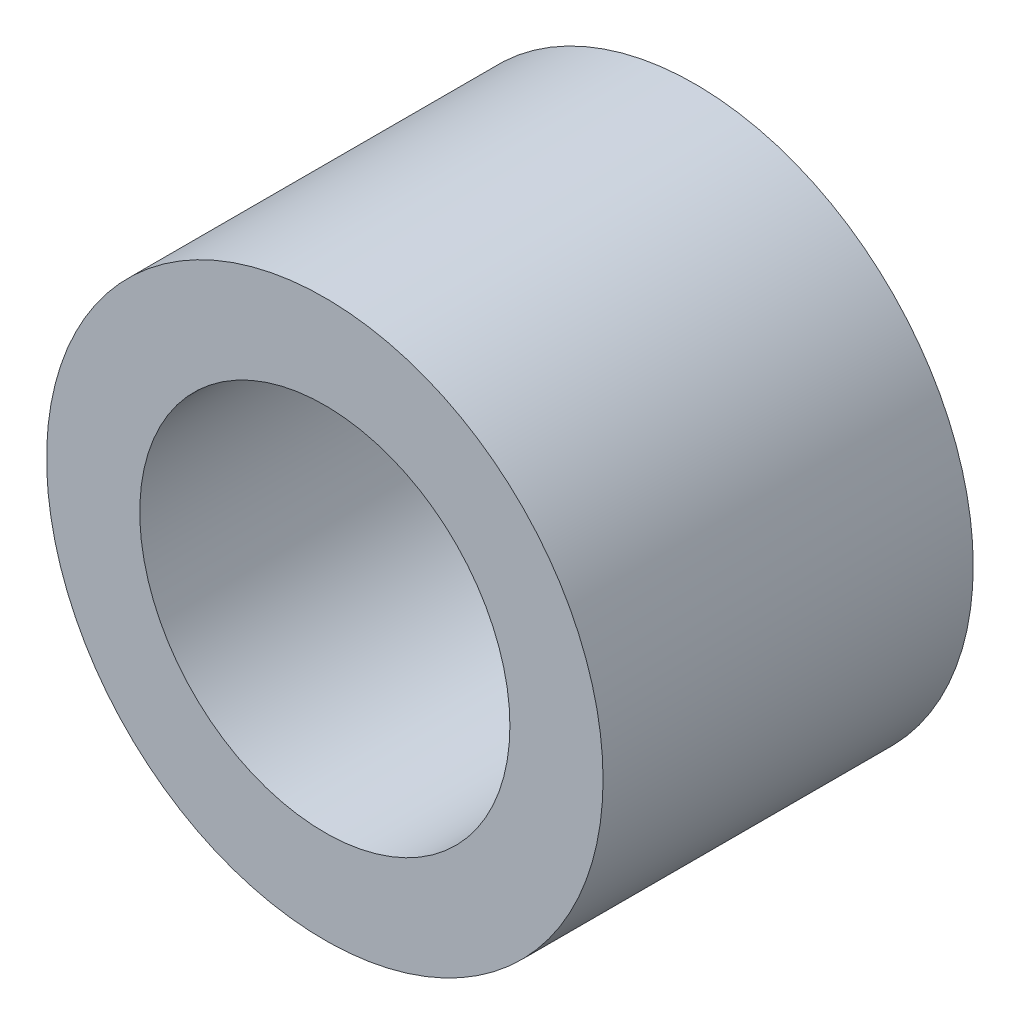
ISO-10303-21;
HEADER;
FILE_DESCRIPTION(('STEP AP214'),'2;1');
FILE_NAME('part.step','',(''),(''),'','','');
FILE_SCHEMA(('AUTOMOTIVE_DESIGN { 1 0 10303 214 1 1 1 1 }'));
ENDSEC;
DATA;
#1=APPLICATION_CONTEXT('core data for automotive mechanical design processes');
#2=APPLICATION_PROTOCOL_DEFINITION('international standard','automotive_design',2000,#1);
#3=PRODUCT_CONTEXT('',#1,'mechanical');
#4=PRODUCT('Part','Part','',(#3));
#5=PRODUCT_RELATED_PRODUCT_CATEGORY('part','',(#4));
#6=PRODUCT_DEFINITION_FORMATION('','',#4);
#7=PRODUCT_DEFINITION_CONTEXT('part definition',#1,'design');
#8=PRODUCT_DEFINITION('design','',#6,#7);
#9=PRODUCT_DEFINITION_SHAPE('','',#8);
#10=(LENGTH_UNIT() NAMED_UNIT(*) SI_UNIT(.MILLI.,.METRE.));
#11=(NAMED_UNIT(*) PLANE_ANGLE_UNIT() SI_UNIT($,.RADIAN.));
#12=(NAMED_UNIT(*) SI_UNIT($,.STERADIAN.) SOLID_ANGLE_UNIT());
#13=UNCERTAINTY_MEASURE_WITH_UNIT(LENGTH_MEASURE(1.E-05),#10,'distance_accuracy_value','');
#14=(GEOMETRIC_REPRESENTATION_CONTEXT(3) GLOBAL_UNCERTAINTY_ASSIGNED_CONTEXT((#13)) GLOBAL_UNIT_ASSIGNED_CONTEXT((#10,
#11,#12)) REPRESENTATION_CONTEXT('',''));
#15=CARTESIAN_POINT('',(0.,0.,0.));
#16=DIRECTION('',(0.,0.,1.));
#17=DIRECTION('',(1.,0.,0.));
#18=AXIS2_PLACEMENT_3D('',#15,#16,#17);
#19=CARTESIAN_POINT('',(0.,0.,3.));
#20=DIRECTION('',(0.,0.,1.));
#21=DIRECTION('',(1.,0.,0.));
#22=AXIS2_PLACEMENT_3D('',#19,#20,#21);
#23=PLANE('',#22);
#24=CARTESIAN_POINT('',(0.,0.,3.));
#25=DIRECTION('',(0.,0.,1.));
#26=DIRECTION('',(1.,0.,0.));
#27=AXIS2_PLACEMENT_3D('',#24,#25,#26);
#28=CIRCLE('',#27,4.51);
#29=CARTESIAN_POINT('',(4.51,0.,3.));
#30=VERTEX_POINT('',#29);
#31=EDGE_CURVE('E10',#30,#30,#28,.T.);
#32=ORIENTED_EDGE('',*,*,#31,.T.);
#33=EDGE_LOOP('',(#32));
#34=FACE_BOUND('',#33,.T.);
#35=CARTESIAN_POINT('',(0.,0.,3.));
#36=DIRECTION('',(0.,0.,1.));
#37=DIRECTION('',(1.,0.,0.));
#38=AXIS2_PLACEMENT_3D('',#35,#36,#37);
#39=CIRCLE('',#38,3.);
#40=CARTESIAN_POINT('',(3.,0.,3.));
#41=VERTEX_POINT('',#40);
#42=EDGE_CURVE('E43',#41,#41,#39,.T.);
#43=ORIENTED_EDGE('',*,*,#42,.F.);
#44=EDGE_LOOP('',(#43));
#45=FACE_BOUND('',#44,.T.);
#46=ADVANCED_FACE('F32',(#34,#45),#23,.T.);
#47=CARTESIAN_POINT('',(0.,0.,-3.));
#48=DIRECTION('',(0.,0.,1.));
#49=DIRECTION('',(1.,0.,0.));
#50=AXIS2_PLACEMENT_3D('',#47,#48,#49);
#51=PLANE('',#50);
#52=CARTESIAN_POINT('',(0.,0.,-3.));
#53=DIRECTION('',(0.,0.,1.));
#54=DIRECTION('',(1.,0.,0.));
#55=AXIS2_PLACEMENT_3D('',#52,#53,#54);
#56=CIRCLE('',#55,4.51);
#57=CARTESIAN_POINT('',(4.51,0.,-3.));
#58=VERTEX_POINT('',#57);
#59=EDGE_CURVE('E36',#58,#58,#56,.T.);
#60=ORIENTED_EDGE('',*,*,#59,.F.);
#61=EDGE_LOOP('',(#60));
#62=FACE_BOUND('',#61,.T.);
#63=CARTESIAN_POINT('',(0.,0.,-3.));
#64=DIRECTION('',(0.,0.,1.));
#65=DIRECTION('',(1.,0.,0.));
#66=AXIS2_PLACEMENT_3D('',#63,#64,#65);
#67=CIRCLE('',#66,3.);
#68=CARTESIAN_POINT('',(3.,0.,-3.));
#69=VERTEX_POINT('',#68);
#70=EDGE_CURVE('E45',#69,#69,#67,.T.);
#71=ORIENTED_EDGE('',*,*,#70,.T.);
#72=EDGE_LOOP('',(#71));
#73=FACE_BOUND('',#72,.T.);
#74=ADVANCED_FACE('F55',(#62,#73),#51,.F.);
#75=CARTESIAN_POINT('',(0.,0.,3.));
#76=DIRECTION('',(0.,0.,-1.));
#77=DIRECTION('',(-1.,0.,0.));
#78=AXIS2_PLACEMENT_3D('',#75,#76,#77);
#79=CYLINDRICAL_SURFACE('',#78,4.51);
#80=ORIENTED_EDGE('',*,*,#31,.F.);
#81=EDGE_LOOP('',(#80));
#82=FACE_BOUND('',#81,.T.);
#83=ORIENTED_EDGE('',*,*,#59,.T.);
#84=EDGE_LOOP('',(#83));
#85=FACE_BOUND('',#84,.T.);
#86=ADVANCED_FACE('F34',(#82,#85),#79,.T.);
#87=CARTESIAN_POINT('',(0.,0.,3.));
#88=DIRECTION('',(0.,0.,-1.));
#89=DIRECTION('',(-1.,0.,0.));
#90=AXIS2_PLACEMENT_3D('',#87,#88,#89);
#91=CYLINDRICAL_SURFACE('',#90,3.);
#92=ORIENTED_EDGE('',*,*,#42,.T.);
#93=EDGE_LOOP('',(#92));
#94=FACE_BOUND('',#93,.T.);
#95=ORIENTED_EDGE('',*,*,#70,.F.);
#96=EDGE_LOOP('',(#95));
#97=FACE_BOUND('',#96,.T.);
#98=ADVANCED_FACE('F51',(#94,#97),#91,.F.);
#99=CLOSED_SHELL('',(#46,#74,#86,#98));
#100=MANIFOLD_SOLID_BREP('B2',#99);
#101=ADVANCED_BREP_SHAPE_REPRESENTATION('',(#18,#100),#14);
#102=SHAPE_DEFINITION_REPRESENTATION(#9,#101);
ENDSEC;
END-ISO-10303-21;
